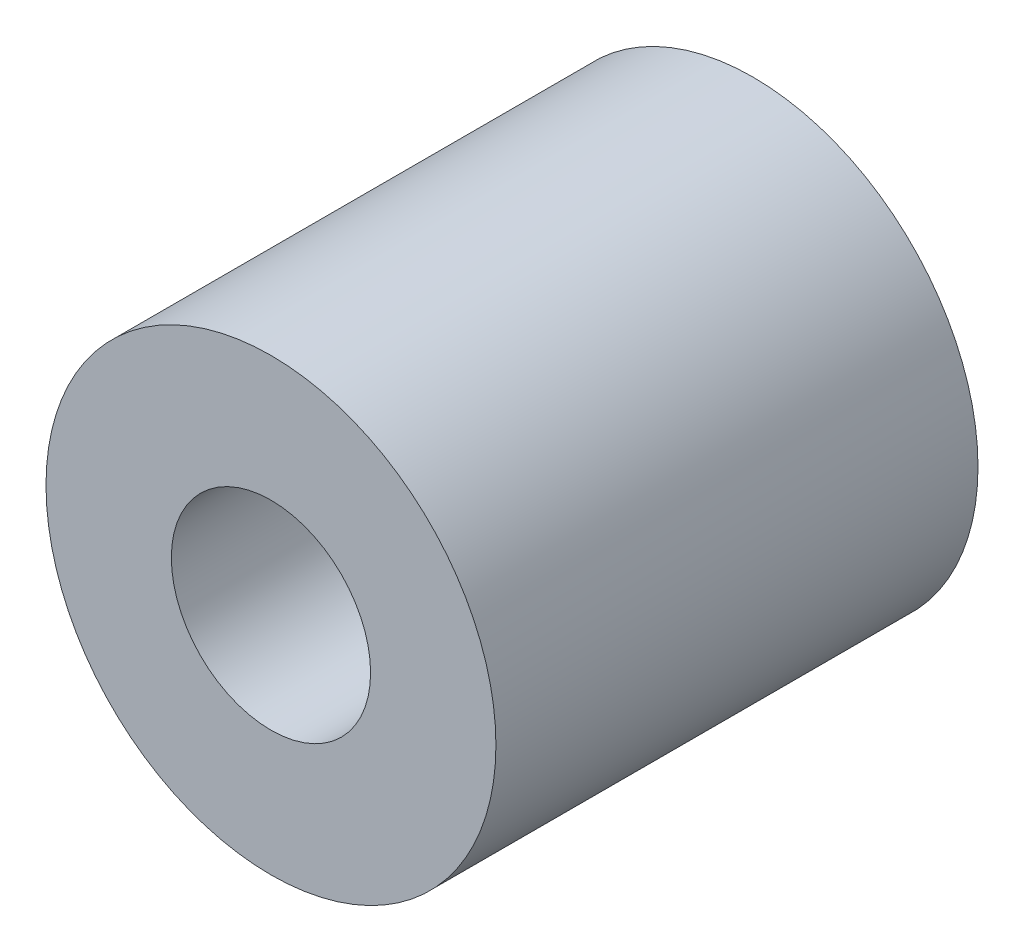
ISO-10303-21;
HEADER;
FILE_DESCRIPTION(('STEP AP214'),'2;1');
FILE_NAME('part.step','',(''),(''),'','','');
FILE_SCHEMA(('AUTOMOTIVE_DESIGN { 1 0 10303 214 1 1 1 1 }'));
ENDSEC;
DATA;
#1=APPLICATION_CONTEXT('core data for automotive mechanical design processes');
#2=APPLICATION_PROTOCOL_DEFINITION('international standard','automotive_design',2000,#1);
#3=PRODUCT_CONTEXT('',#1,'mechanical');
#4=PRODUCT('Part','Part','',(#3));
#5=PRODUCT_RELATED_PRODUCT_CATEGORY('part','',(#4));
#6=PRODUCT_DEFINITION_FORMATION('','',#4);
#7=PRODUCT_DEFINITION_CONTEXT('part definition',#1,'design');
#8=PRODUCT_DEFINITION('design','',#6,#7);
#9=PRODUCT_DEFINITION_SHAPE('','',#8);
#10=(LENGTH_UNIT() NAMED_UNIT(*) SI_UNIT(.MILLI.,.METRE.));
#11=(NAMED_UNIT(*) PLANE_ANGLE_UNIT() SI_UNIT($,.RADIAN.));
#12=(NAMED_UNIT(*) SI_UNIT($,.STERADIAN.) SOLID_ANGLE_UNIT());
#13=UNCERTAINTY_MEASURE_WITH_UNIT(LENGTH_MEASURE(1.E-05),#10,'distance_accuracy_value','');
#14=(GEOMETRIC_REPRESENTATION_CONTEXT(3) GLOBAL_UNCERTAINTY_ASSIGNED_CONTEXT((#13)) GLOBAL_UNIT_ASSIGNED_CONTEXT((#10,
#11,#12)) REPRESENTATION_CONTEXT('',''));
#15=CARTESIAN_POINT('',(0.,0.,0.));
#16=DIRECTION('',(0.,0.,1.));
#17=DIRECTION('',(1.,0.,0.));
#18=AXIS2_PLACEMENT_3D('',#15,#16,#17);
#19=CARTESIAN_POINT('',(0.,0.,19.05));
#20=DIRECTION('',(0.,0.,-1.));
#21=DIRECTION('',(-1.,0.,0.));
#22=AXIS2_PLACEMENT_3D('',#19,#20,#21);
#23=CYLINDRICAL_SURFACE('',#22,8.88999999999999);
#24=CARTESIAN_POINT('',(0.,0.,19.05));
#25=DIRECTION('',(0.,0.,1.));
#26=DIRECTION('',(1.,0.,0.));
#27=AXIS2_PLACEMENT_3D('',#24,#25,#26);
#28=CIRCLE('',#27,8.88999999999999);
#29=CARTESIAN_POINT('',(8.88999999999999,0.,19.05));
#30=VERTEX_POINT('',#29);
#31=EDGE_CURVE('E10',#30,#30,#28,.T.);
#32=ORIENTED_EDGE('',*,*,#31,.F.);
#33=EDGE_LOOP('',(#32));
#34=FACE_BOUND('',#33,.T.);
#35=CARTESIAN_POINT('',(0.,0.,0.));
#36=DIRECTION('',(0.,0.,1.));
#37=DIRECTION('',(1.,0.,0.));
#38=AXIS2_PLACEMENT_3D('',#35,#36,#37);
#39=CIRCLE('',#38,8.88999999999999);
#40=CARTESIAN_POINT('',(8.88999999999999,0.,0.));
#41=VERTEX_POINT('',#40);
#42=EDGE_CURVE('E38',#41,#41,#39,.T.);
#43=ORIENTED_EDGE('',*,*,#42,.T.);
#44=EDGE_LOOP('',(#43));
#45=FACE_BOUND('',#44,.T.);
#46=ADVANCED_FACE('F31',(#34,#45),#23,.T.);
#47=CARTESIAN_POINT('',(0.,0.,19.05));
#48=DIRECTION('',(0.,0.,1.));
#49=DIRECTION('',(1.,0.,0.));
#50=AXIS2_PLACEMENT_3D('',#47,#48,#49);
#51=PLANE('',#50);
#52=CARTESIAN_POINT('',(0.,0.,19.05));
#53=DIRECTION('',(0.,0.,1.));
#54=DIRECTION('',(1.,0.,0.));
#55=AXIS2_PLACEMENT_3D('',#52,#53,#54);
#56=CIRCLE('',#55,3.937);
#57=CARTESIAN_POINT('',(3.937,0.,19.05));
#58=VERTEX_POINT('',#57);
#59=EDGE_CURVE('E44',#58,#58,#56,.T.);
#60=ORIENTED_EDGE('',*,*,#59,.F.);
#61=EDGE_LOOP('',(#60));
#62=FACE_BOUND('',#61,.T.);
#63=ORIENTED_EDGE('',*,*,#31,.T.);
#64=EDGE_LOOP('',(#63));
#65=FACE_BOUND('',#64,.T.);
#66=ADVANCED_FACE('F60',(#62,#65),#51,.T.);
#67=CARTESIAN_POINT('',(0.,0.,0.));
#68=DIRECTION('',(0.,0.,1.));
#69=DIRECTION('',(1.,0.,0.));
#70=AXIS2_PLACEMENT_3D('',#67,#68,#69);
#71=PLANE('',#70);
#72=CARTESIAN_POINT('',(0.,0.,0.));
#73=DIRECTION('',(0.,0.,1.));
#74=DIRECTION('',(1.,0.,0.));
#75=AXIS2_PLACEMENT_3D('',#72,#73,#74);
#76=CIRCLE('',#75,3.937);
#77=CARTESIAN_POINT('',(3.937,0.,0.));
#78=VERTEX_POINT('',#77);
#79=EDGE_CURVE('E34',#78,#78,#76,.T.);
#80=ORIENTED_EDGE('',*,*,#79,.T.);
#81=EDGE_LOOP('',(#80));
#82=FACE_BOUND('',#81,.T.);
#83=ORIENTED_EDGE('',*,*,#42,.F.);
#84=EDGE_LOOP('',(#83));
#85=FACE_BOUND('',#84,.T.);
#86=ADVANCED_FACE('F51',(#82,#85),#71,.F.);
#87=CARTESIAN_POINT('',(0.,0.,-0.507999999999967));
#88=DIRECTION('',(0.,0.,1.));
#89=DIRECTION('',(1.,0.,0.));
#90=AXIS2_PLACEMENT_3D('',#87,#88,#89);
#91=CYLINDRICAL_SURFACE('',#90,3.937);
#92=ORIENTED_EDGE('',*,*,#59,.T.);
#93=EDGE_LOOP('',(#92));
#94=FACE_BOUND('',#93,.T.);
#95=ORIENTED_EDGE('',*,*,#79,.F.);
#96=EDGE_LOOP('',(#95));
#97=FACE_BOUND('',#96,.T.);
#98=ADVANCED_FACE('F54',(#94,#97),#91,.F.);
#99=CLOSED_SHELL('',(#46,#66,#86,#98));
#100=MANIFOLD_SOLID_BREP('B2',#99);
#101=ADVANCED_BREP_SHAPE_REPRESENTATION('',(#18,#100),#14);
#102=SHAPE_DEFINITION_REPRESENTATION(#9,#101);
ENDSEC;
END-ISO-10303-21;
